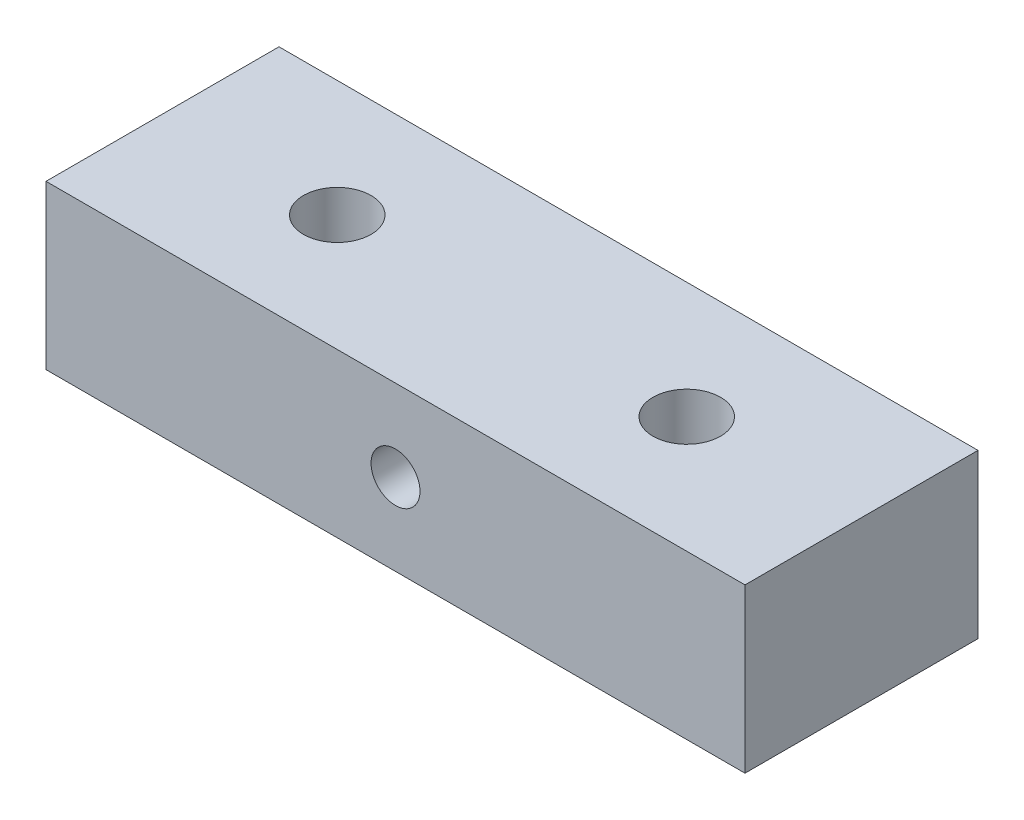
ISO-10303-21;
HEADER;
FILE_DESCRIPTION(('STEP AP214'),'2;1');
FILE_NAME('part.step','',(''),(''),'','','');
FILE_SCHEMA(('AUTOMOTIVE_DESIGN { 1 0 10303 214 1 1 1 1 }'));
ENDSEC;
DATA;
#1=APPLICATION_CONTEXT('core data for automotive mechanical design processes');
#2=APPLICATION_PROTOCOL_DEFINITION('international standard','automotive_design',2000,#1);
#3=PRODUCT_CONTEXT('',#1,'mechanical');
#4=PRODUCT('Part','Part','',(#3));
#5=PRODUCT_RELATED_PRODUCT_CATEGORY('part','',(#4));
#6=PRODUCT_DEFINITION_FORMATION('','',#4);
#7=PRODUCT_DEFINITION_CONTEXT('part definition',#1,'design');
#8=PRODUCT_DEFINITION('design','',#6,#7);
#9=PRODUCT_DEFINITION_SHAPE('','',#8);
#10=(LENGTH_UNIT() NAMED_UNIT(*) SI_UNIT(.MILLI.,.METRE.));
#11=(NAMED_UNIT(*) PLANE_ANGLE_UNIT() SI_UNIT($,.RADIAN.));
#12=(NAMED_UNIT(*) SI_UNIT($,.STERADIAN.) SOLID_ANGLE_UNIT());
#13=UNCERTAINTY_MEASURE_WITH_UNIT(LENGTH_MEASURE(1.E-05),#10,'distance_accuracy_value','');
#14=(GEOMETRIC_REPRESENTATION_CONTEXT(3) GLOBAL_UNCERTAINTY_ASSIGNED_CONTEXT((#13)) GLOBAL_UNIT_ASSIGNED_CONTEXT((#10,
#11,#12)) REPRESENTATION_CONTEXT('',''));
#15=CARTESIAN_POINT('',(0.,0.,0.));
#16=DIRECTION('',(0.,0.,1.));
#17=DIRECTION('',(1.,0.,0.));
#18=AXIS2_PLACEMENT_3D('',#15,#16,#17);
#19=CARTESIAN_POINT('',(0.,0.,10.));
#20=DIRECTION('',(1.,0.,0.));
#21=DIRECTION('',(0.,0.,-1.));
#22=AXIS2_PLACEMENT_3D('',#19,#20,#21);
#23=PLANE('',#22);
#24=DIRECTION('',(0.,-1.,0.));
#25=VECTOR('',#24,1.);
#26=CARTESIAN_POINT('',(0.,0.,0.));
#27=LINE('',#26,#25);
#28=CARTESIAN_POINT('',(0.,7.,0.));
#29=VERTEX_POINT('',#28);
#30=CARTESIAN_POINT('',(0.,0.,0.));
#31=VERTEX_POINT('',#30);
#32=EDGE_CURVE('E111',#29,#31,#27,.T.);
#33=ORIENTED_EDGE('',*,*,#32,.T.);
#34=DIRECTION('',(0.,0.,-1.));
#35=VECTOR('',#34,1.);
#36=CARTESIAN_POINT('',(0.,0.,10.));
#37=LINE('',#36,#35);
#38=CARTESIAN_POINT('',(0.,0.,10.));
#39=VERTEX_POINT('',#38);
#40=EDGE_CURVE('E11',#39,#31,#37,.T.);
#41=ORIENTED_EDGE('',*,*,#40,.F.);
#42=DIRECTION('',(0.,-1.,0.));
#43=VECTOR('',#42,1.);
#44=CARTESIAN_POINT('',(0.,0.,10.));
#45=LINE('',#44,#43);
#46=CARTESIAN_POINT('',(0.,7.,10.));
#47=VERTEX_POINT('',#46);
#48=EDGE_CURVE('E95',#47,#39,#45,.T.);
#49=ORIENTED_EDGE('',*,*,#48,.F.);
#50=DIRECTION('',(0.,0.,-1.));
#51=VECTOR('',#50,1.);
#52=CARTESIAN_POINT('',(0.,7.,10.));
#53=LINE('',#52,#51);
#54=EDGE_CURVE('E107',#47,#29,#53,.T.);
#55=ORIENTED_EDGE('',*,*,#54,.T.);
#56=EDGE_LOOP('',(#33,#41,#49,#55));
#57=FACE_BOUND('',#56,.T.);
#58=ADVANCED_FACE('F43',(#57),#23,.F.);
#59=CARTESIAN_POINT('',(0.,0.,10.));
#60=DIRECTION('',(0.,1.,0.));
#61=DIRECTION('',(0.,0.,1.));
#62=AXIS2_PLACEMENT_3D('',#59,#60,#61);
#63=PLANE('',#62);
#64=CARTESIAN_POINT('',(7.5,0.,5.));
#65=DIRECTION('',(0.,1.,0.));
#66=DIRECTION('',(0.,0.,1.));
#67=AXIS2_PLACEMENT_3D('',#64,#65,#66);
#68=CIRCLE('',#67,1.45);
#69=CARTESIAN_POINT('',(7.5,0.,6.45));
#70=VERTEX_POINT('',#69);
#71=EDGE_CURVE('E139',#70,#70,#68,.T.);
#72=ORIENTED_EDGE('',*,*,#71,.T.);
#73=EDGE_LOOP('',(#72));
#74=FACE_BOUND('',#73,.T.);
#75=CARTESIAN_POINT('',(22.5,0.,5.));
#76=DIRECTION('',(0.,1.,0.));
#77=DIRECTION('',(0.,0.,1.));
#78=AXIS2_PLACEMENT_3D('',#75,#76,#77);
#79=CIRCLE('',#78,1.45);
#80=CARTESIAN_POINT('',(22.5,0.,6.45));
#81=VERTEX_POINT('',#80);
#82=EDGE_CURVE('E140',#81,#81,#79,.T.);
#83=ORIENTED_EDGE('',*,*,#82,.T.);
#84=EDGE_LOOP('',(#83));
#85=FACE_BOUND('',#84,.T.);
#86=DIRECTION('',(1.,0.,0.));
#87=VECTOR('',#86,1.);
#88=CARTESIAN_POINT('',(0.,0.,0.));
#89=LINE('',#88,#87);
#90=CARTESIAN_POINT('',(30.,0.,0.));
#91=VERTEX_POINT('',#90);
#92=EDGE_CURVE('E100',#31,#91,#89,.T.);
#93=ORIENTED_EDGE('',*,*,#92,.T.);
#94=DIRECTION('',(0.,0.,-1.));
#95=VECTOR('',#94,1.);
#96=CARTESIAN_POINT('',(30.,0.,10.));
#97=LINE('',#96,#95);
#98=CARTESIAN_POINT('',(30.,0.,10.));
#99=VERTEX_POINT('',#98);
#100=EDGE_CURVE('E52',#99,#91,#97,.T.);
#101=ORIENTED_EDGE('',*,*,#100,.F.);
#102=DIRECTION('',(1.,0.,0.));
#103=VECTOR('',#102,1.);
#104=CARTESIAN_POINT('',(0.,0.,10.));
#105=LINE('',#104,#103);
#106=EDGE_CURVE('E90',#39,#99,#105,.T.);
#107=ORIENTED_EDGE('',*,*,#106,.F.);
#108=ORIENTED_EDGE('',*,*,#40,.T.);
#109=EDGE_LOOP('',(#93,#101,#107,#108));
#110=FACE_BOUND('',#109,.T.);
#111=ADVANCED_FACE('F99',(#74,#85,#110),#63,.F.);
#112=CARTESIAN_POINT('',(30.,0.,10.));
#113=DIRECTION('',(-1.,0.,0.));
#114=DIRECTION('',(0.,0.,1.));
#115=AXIS2_PLACEMENT_3D('',#112,#113,#114);
#116=PLANE('',#115);
#117=DIRECTION('',(0.,1.,0.));
#118=VECTOR('',#117,1.);
#119=CARTESIAN_POINT('',(30.,0.,0.));
#120=LINE('',#119,#118);
#121=CARTESIAN_POINT('',(30.,7.,0.));
#122=VERTEX_POINT('',#121);
#123=EDGE_CURVE('E77',#91,#122,#120,.T.);
#124=ORIENTED_EDGE('',*,*,#123,.T.);
#125=DIRECTION('',(0.,0.,-1.));
#126=VECTOR('',#125,1.);
#127=CARTESIAN_POINT('',(30.,7.,10.));
#128=LINE('',#127,#126);
#129=CARTESIAN_POINT('',(30.,7.,10.));
#130=VERTEX_POINT('',#129);
#131=EDGE_CURVE('E102',#130,#122,#128,.T.);
#132=ORIENTED_EDGE('',*,*,#131,.F.);
#133=DIRECTION('',(0.,1.,0.));
#134=VECTOR('',#133,1.);
#135=CARTESIAN_POINT('',(30.,0.,10.));
#136=LINE('',#135,#134);
#137=EDGE_CURVE('E93',#99,#130,#136,.T.);
#138=ORIENTED_EDGE('',*,*,#137,.F.);
#139=ORIENTED_EDGE('',*,*,#100,.T.);
#140=EDGE_LOOP('',(#124,#132,#138,#139));
#141=FACE_BOUND('',#140,.T.);
#142=ADVANCED_FACE('F103',(#141),#116,.F.);
#143=CARTESIAN_POINT('',(0.,7.,10.));
#144=DIRECTION('',(0.,-1.,0.));
#145=DIRECTION('',(0.,0.,-1.));
#146=AXIS2_PLACEMENT_3D('',#143,#144,#145);
#147=PLANE('',#146);
#148=CARTESIAN_POINT('',(7.5,7.,5.));
#149=DIRECTION('',(0.,1.,0.));
#150=DIRECTION('',(0.,0.,1.));
#151=AXIS2_PLACEMENT_3D('',#148,#149,#150);
#152=CIRCLE('',#151,1.45);
#153=CARTESIAN_POINT('',(7.5,7.,6.45));
#154=VERTEX_POINT('',#153);
#155=EDGE_CURVE('E148',#154,#154,#152,.T.);
#156=ORIENTED_EDGE('',*,*,#155,.F.);
#157=EDGE_LOOP('',(#156));
#158=FACE_BOUND('',#157,.T.);
#159=CARTESIAN_POINT('',(22.5,7.,5.));
#160=DIRECTION('',(0.,1.,0.));
#161=DIRECTION('',(0.,0.,1.));
#162=AXIS2_PLACEMENT_3D('',#159,#160,#161);
#163=CIRCLE('',#162,1.45);
#164=CARTESIAN_POINT('',(22.5,7.,6.45));
#165=VERTEX_POINT('',#164);
#166=EDGE_CURVE('E144',#165,#165,#163,.T.);
#167=ORIENTED_EDGE('',*,*,#166,.F.);
#168=EDGE_LOOP('',(#167));
#169=FACE_BOUND('',#168,.T.);
#170=DIRECTION('',(-1.,0.,0.));
#171=VECTOR('',#170,1.);
#172=CARTESIAN_POINT('',(0.,7.,0.));
#173=LINE('',#172,#171);
#174=EDGE_CURVE('E83',#122,#29,#173,.T.);
#175=ORIENTED_EDGE('',*,*,#174,.T.);
#176=ORIENTED_EDGE('',*,*,#54,.F.);
#177=DIRECTION('',(-1.,0.,0.));
#178=VECTOR('',#177,1.);
#179=CARTESIAN_POINT('',(0.,7.,10.));
#180=LINE('',#179,#178);
#181=EDGE_CURVE('E60',#130,#47,#180,.T.);
#182=ORIENTED_EDGE('',*,*,#181,.F.);
#183=ORIENTED_EDGE('',*,*,#131,.T.);
#184=EDGE_LOOP('',(#175,#176,#182,#183));
#185=FACE_BOUND('',#184,.T.);
#186=ADVANCED_FACE('F125',(#158,#169,#185),#147,.F.);
#187=CARTESIAN_POINT('',(0.,0.,10.));
#188=DIRECTION('',(0.,0.,-1.));
#189=DIRECTION('',(-1.,0.,0.));
#190=AXIS2_PLACEMENT_3D('',#187,#188,#189);
#191=PLANE('',#190);
#192=CARTESIAN_POINT('',(15.,3.5,10.));
#193=DIRECTION('',(0.,0.,1.));
#194=DIRECTION('',(1.,0.,0.));
#195=AXIS2_PLACEMENT_3D('',#192,#193,#194);
#196=CIRCLE('',#195,1.05);
#197=CARTESIAN_POINT('',(16.05,3.5,10.));
#198=VERTEX_POINT('',#197);
#199=EDGE_CURVE('E135',#198,#198,#196,.T.);
#200=ORIENTED_EDGE('',*,*,#199,.F.);
#201=EDGE_LOOP('',(#200));
#202=FACE_BOUND('',#201,.T.);
#203=ORIENTED_EDGE('',*,*,#48,.T.);
#204=ORIENTED_EDGE('',*,*,#106,.T.);
#205=ORIENTED_EDGE('',*,*,#137,.T.);
#206=ORIENTED_EDGE('',*,*,#181,.T.);
#207=EDGE_LOOP('',(#203,#204,#205,#206));
#208=FACE_BOUND('',#207,.T.);
#209=ADVANCED_FACE('F91',(#202,#208),#191,.F.);
#210=CARTESIAN_POINT('',(0.,0.,0.));
#211=DIRECTION('',(0.,0.,-1.));
#212=DIRECTION('',(-1.,0.,0.));
#213=AXIS2_PLACEMENT_3D('',#210,#211,#212);
#214=PLANE('',#213);
#215=CARTESIAN_POINT('',(15.,3.5,0.));
#216=DIRECTION('',(0.,0.,-1.));
#217=DIRECTION('',(-1.,0.,0.));
#218=AXIS2_PLACEMENT_3D('',#215,#216,#217);
#219=CIRCLE('',#218,1.05);
#220=CARTESIAN_POINT('',(13.95,3.5,0.));
#221=VERTEX_POINT('',#220);
#222=EDGE_CURVE('E115',#221,#221,#219,.F.);
#223=ORIENTED_EDGE('',*,*,#222,.T.);
#224=EDGE_LOOP('',(#223));
#225=FACE_BOUND('',#224,.T.);
#226=ORIENTED_EDGE('',*,*,#32,.F.);
#227=ORIENTED_EDGE('',*,*,#174,.F.);
#228=ORIENTED_EDGE('',*,*,#123,.F.);
#229=ORIENTED_EDGE('',*,*,#92,.F.);
#230=EDGE_LOOP('',(#226,#227,#228,#229));
#231=FACE_BOUND('',#230,.T.);
#232=ADVANCED_FACE('F128',(#225,#231),#214,.T.);
#233=CARTESIAN_POINT('',(15.,3.5,-2.9698484809835));
#234=DIRECTION('',(0.,0.,1.));
#235=DIRECTION('',(1.,0.,0.));
#236=AXIS2_PLACEMENT_3D('',#233,#234,#235);
#237=CYLINDRICAL_SURFACE('',#236,1.05);
#238=ORIENTED_EDGE('',*,*,#199,.T.);
#239=EDGE_LOOP('',(#238));
#240=FACE_BOUND('',#239,.T.);
#241=ORIENTED_EDGE('',*,*,#222,.F.);
#242=EDGE_LOOP('',(#241));
#243=FACE_BOUND('',#242,.T.);
#244=ADVANCED_FACE('F171',(#240,#243),#237,.F.);
#245=CARTESIAN_POINT('',(22.5,0.,5.));
#246=DIRECTION('',(0.,1.,0.));
#247=DIRECTION('',(0.,0.,1.));
#248=AXIS2_PLACEMENT_3D('',#245,#246,#247);
#249=CYLINDRICAL_SURFACE('',#248,1.45);
#250=ORIENTED_EDGE('',*,*,#82,.F.);
#251=EDGE_LOOP('',(#250));
#252=FACE_BOUND('',#251,.T.);
#253=ORIENTED_EDGE('',*,*,#166,.T.);
#254=EDGE_LOOP('',(#253));
#255=FACE_BOUND('',#254,.T.);
#256=ADVANCED_FACE('F161',(#252,#255),#249,.F.);
#257=CARTESIAN_POINT('',(7.5,0.,5.));
#258=DIRECTION('',(0.,1.,0.));
#259=DIRECTION('',(0.,0.,1.));
#260=AXIS2_PLACEMENT_3D('',#257,#258,#259);
#261=CYLINDRICAL_SURFACE('',#260,1.45);
#262=ORIENTED_EDGE('',*,*,#71,.F.);
#263=EDGE_LOOP('',(#262));
#264=FACE_BOUND('',#263,.T.);
#265=ORIENTED_EDGE('',*,*,#155,.T.);
#266=EDGE_LOOP('',(#265));
#267=FACE_BOUND('',#266,.T.);
#268=ADVANCED_FACE('F158',(#264,#267),#261,.F.);
#269=CLOSED_SHELL('',(#58,#111,#142,#186,#209,#232,#244,#256,#268));
#270=MANIFOLD_SOLID_BREP('B2',#269);
#271=ADVANCED_BREP_SHAPE_REPRESENTATION('',(#18,#270),#14);
#272=SHAPE_DEFINITION_REPRESENTATION(#9,#271);
ENDSEC;
END-ISO-10303-21;
